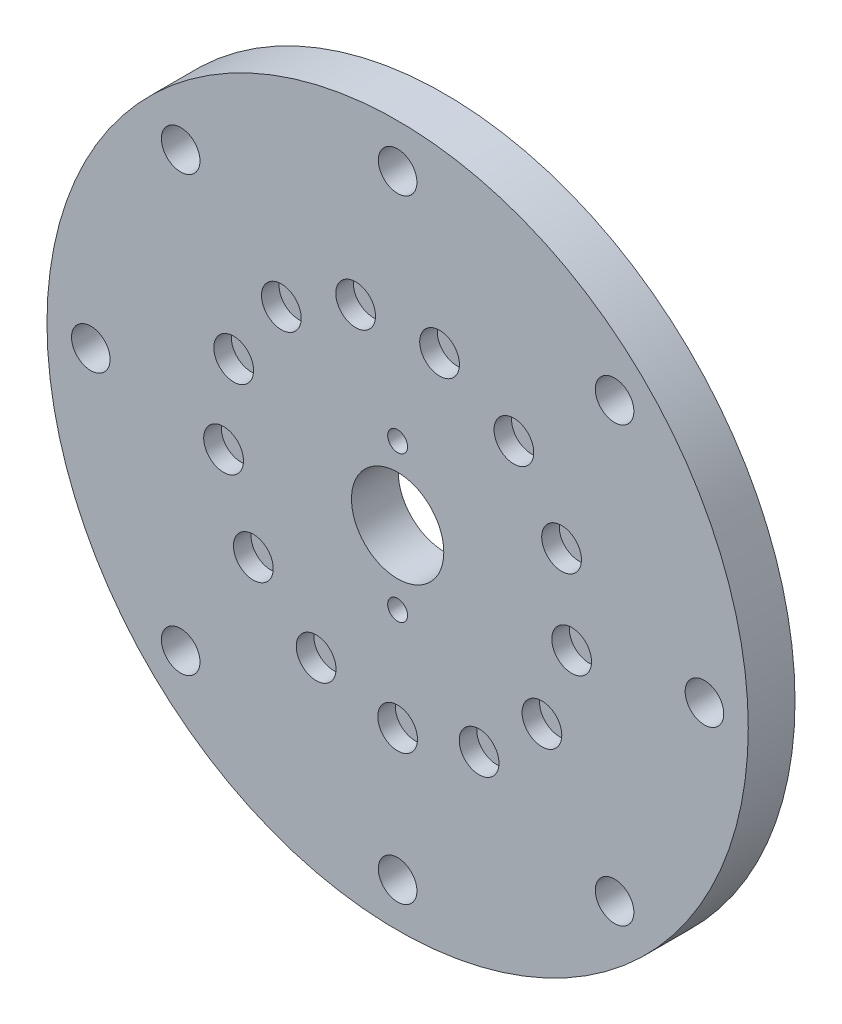
ISO-10303-21;
HEADER;
FILE_DESCRIPTION(('STEP AP214'),'2;1');
FILE_NAME('part.step','',(''),(''),'','','');
FILE_SCHEMA(('AUTOMOTIVE_DESIGN { 1 0 10303 214 1 1 1 1 }'));
ENDSEC;
DATA;
#1=APPLICATION_CONTEXT('core data for automotive mechanical design processes');
#2=APPLICATION_PROTOCOL_DEFINITION('international standard','automotive_design',2000,#1);
#3=PRODUCT_CONTEXT('',#1,'mechanical');
#4=PRODUCT('Part','Part','',(#3));
#5=PRODUCT_RELATED_PRODUCT_CATEGORY('part','',(#4));
#6=PRODUCT_DEFINITION_FORMATION('','',#4);
#7=PRODUCT_DEFINITION_CONTEXT('part definition',#1,'design');
#8=PRODUCT_DEFINITION('design','',#6,#7);
#9=PRODUCT_DEFINITION_SHAPE('','',#8);
#10=(LENGTH_UNIT() NAMED_UNIT(*) SI_UNIT(.MILLI.,.METRE.));
#11=(NAMED_UNIT(*) PLANE_ANGLE_UNIT() SI_UNIT($,.RADIAN.));
#12=(NAMED_UNIT(*) SI_UNIT($,.STERADIAN.) SOLID_ANGLE_UNIT());
#13=UNCERTAINTY_MEASURE_WITH_UNIT(LENGTH_MEASURE(1.E-05),#10,'distance_accuracy_value','');
#14=(GEOMETRIC_REPRESENTATION_CONTEXT(3) GLOBAL_UNCERTAINTY_ASSIGNED_CONTEXT((#13)) GLOBAL_UNIT_ASSIGNED_CONTEXT((#10,
#11,#12)) REPRESENTATION_CONTEXT('',''));
#15=CARTESIAN_POINT('',(0.,0.,0.));
#16=DIRECTION('',(0.,0.,1.));
#17=DIRECTION('',(1.,0.,0.));
#18=AXIS2_PLACEMENT_3D('',#15,#16,#17);
#19=CARTESIAN_POINT('',(0.,0.,8.));
#20=DIRECTION('',(0.,0.,1.));
#21=DIRECTION('',(1.,0.,0.));
#22=AXIS2_PLACEMENT_3D('',#19,#20,#21);
#23=PLANE('',#22);
#24=CARTESIAN_POINT('',(0.,52.5,8.));
#25=DIRECTION('',(0.,0.,1.));
#26=DIRECTION('',(1.,0.,0.));
#27=AXIS2_PLACEMENT_3D('',#24,#25,#26);
#28=CIRCLE('',#27,3.29999999999999);
#29=CARTESIAN_POINT('',(3.29999999999999,52.5,8.));
#30=VERTEX_POINT('',#29);
#31=EDGE_CURVE('E190',#30,#30,#28,.T.);
#32=ORIENTED_EDGE('',*,*,#31,.F.);
#33=EDGE_LOOP('',(#32));
#34=FACE_BOUND('',#33,.T.);
#35=CARTESIAN_POINT('',(37.1231060122937,37.1231060122937,8.));
#36=DIRECTION('',(0.,0.,1.));
#37=DIRECTION('',(1.,0.,0.));
#38=AXIS2_PLACEMENT_3D('',#35,#36,#37);
#39=CIRCLE('',#38,3.29999999999998);
#40=CARTESIAN_POINT('',(40.4231060122937,37.1231060122937,8.));
#41=VERTEX_POINT('',#40);
#42=EDGE_CURVE('E184',#41,#41,#39,.T.);
#43=ORIENTED_EDGE('',*,*,#42,.F.);
#44=EDGE_LOOP('',(#43));
#45=FACE_BOUND('',#44,.T.);
#46=CARTESIAN_POINT('',(52.5,0.,8.));
#47=DIRECTION('',(0.,0.,1.));
#48=DIRECTION('',(1.,0.,0.));
#49=AXIS2_PLACEMENT_3D('',#46,#47,#48);
#50=CIRCLE('',#49,3.29999999999998);
#51=CARTESIAN_POINT('',(55.8,0.,8.));
#52=VERTEX_POINT('',#51);
#53=EDGE_CURVE('E178',#52,#52,#50,.T.);
#54=ORIENTED_EDGE('',*,*,#53,.F.);
#55=EDGE_LOOP('',(#54));
#56=FACE_BOUND('',#55,.T.);
#57=CARTESIAN_POINT('',(37.1231060122937,-37.1231060122937,8.));
#58=DIRECTION('',(0.,0.,1.));
#59=DIRECTION('',(1.,0.,0.));
#60=AXIS2_PLACEMENT_3D('',#57,#58,#59);
#61=CIRCLE('',#60,3.29999999999998);
#62=CARTESIAN_POINT('',(40.4231060122937,-37.1231060122937,8.));
#63=VERTEX_POINT('',#62);
#64=EDGE_CURVE('E172',#63,#63,#61,.T.);
#65=ORIENTED_EDGE('',*,*,#64,.F.);
#66=EDGE_LOOP('',(#65));
#67=FACE_BOUND('',#66,.T.);
#68=CARTESIAN_POINT('',(0.,-52.5,8.));
#69=DIRECTION('',(0.,0.,1.));
#70=DIRECTION('',(1.,0.,0.));
#71=AXIS2_PLACEMENT_3D('',#68,#69,#70);
#72=CIRCLE('',#71,3.29999999999999);
#73=CARTESIAN_POINT('',(3.29999999999999,-52.5,8.));
#74=VERTEX_POINT('',#73);
#75=EDGE_CURVE('E166',#74,#74,#72,.T.);
#76=ORIENTED_EDGE('',*,*,#75,.F.);
#77=EDGE_LOOP('',(#76));
#78=FACE_BOUND('',#77,.T.);
#79=CARTESIAN_POINT('',(-37.1231060122937,-37.1231060122937,8.));
#80=DIRECTION('',(0.,0.,1.));
#81=DIRECTION('',(1.,0.,0.));
#82=AXIS2_PLACEMENT_3D('',#79,#80,#81);
#83=CIRCLE('',#82,3.29999999999998);
#84=CARTESIAN_POINT('',(-33.8231060122938,-37.1231060122937,8.));
#85=VERTEX_POINT('',#84);
#86=EDGE_CURVE('E160',#85,#85,#83,.T.);
#87=ORIENTED_EDGE('',*,*,#86,.F.);
#88=EDGE_LOOP('',(#87));
#89=FACE_BOUND('',#88,.T.);
#90=CARTESIAN_POINT('',(-52.5,0.,8.));
#91=DIRECTION('',(0.,0.,1.));
#92=DIRECTION('',(1.,0.,0.));
#93=AXIS2_PLACEMENT_3D('',#90,#91,#92);
#94=CIRCLE('',#93,3.29999999999998);
#95=CARTESIAN_POINT('',(-49.2,0.,8.));
#96=VERTEX_POINT('',#95);
#97=EDGE_CURVE('E154',#96,#96,#94,.T.);
#98=ORIENTED_EDGE('',*,*,#97,.F.);
#99=EDGE_LOOP('',(#98));
#100=FACE_BOUND('',#99,.T.);
#101=CARTESIAN_POINT('',(-37.1231060122937,37.1231060122937,8.));
#102=DIRECTION('',(0.,0.,1.));
#103=DIRECTION('',(1.,0.,0.));
#104=AXIS2_PLACEMENT_3D('',#101,#102,#103);
#105=CIRCLE('',#104,3.29999999999998);
#106=CARTESIAN_POINT('',(-33.8231060122938,37.1231060122937,8.));
#107=VERTEX_POINT('',#106);
#108=EDGE_CURVE('E148',#107,#107,#105,.T.);
#109=ORIENTED_EDGE('',*,*,#108,.F.);
#110=EDGE_LOOP('',(#109));
#111=FACE_BOUND('',#110,.T.);
#112=CARTESIAN_POINT('',(-19.893856446141,22.4551659023116,8.));
#113=DIRECTION('',(0.,0.,1.));
#114=DIRECTION('',(1.,0.,0.));
#115=AXIS2_PLACEMENT_3D('',#112,#113,#114);
#116=CIRCLE('',#115,3.4);
#117=CARTESIAN_POINT('',(-16.493856446141,22.4551659023116,8.));
#118=VERTEX_POINT('',#117);
#119=EDGE_CURVE('E101',#118,#118,#116,.T.);
#120=ORIENTED_EDGE('',*,*,#119,.F.);
#121=EDGE_LOOP('',(#120));
#122=FACE_BOUND('',#121,.T.);
#123=CARTESIAN_POINT('',(-28.0505709906068,10.6379258834103,8.));
#124=DIRECTION('',(0.,0.,1.));
#125=DIRECTION('',(1.,0.,0.));
#126=AXIS2_PLACEMENT_3D('',#123,#124,#125);
#127=CIRCLE('',#126,3.4);
#128=CARTESIAN_POINT('',(-24.6505709906068,10.6379258834103,8.));
#129=VERTEX_POINT('',#128);
#130=EDGE_CURVE('E108',#129,#129,#127,.T.);
#131=ORIENTED_EDGE('',*,*,#130,.F.);
#132=EDGE_LOOP('',(#131));
#133=FACE_BOUND('',#132,.T.);
#134=CARTESIAN_POINT('',(-29.7812377671508,-3.61633475447582,8.));
#135=DIRECTION('',(0.,0.,1.));
#136=DIRECTION('',(1.,0.,0.));
#137=AXIS2_PLACEMENT_3D('',#134,#135,#136);
#138=CIRCLE('',#137,3.4);
#139=CARTESIAN_POINT('',(-26.3812377671508,-3.61633475447582,8.));
#140=VERTEX_POINT('',#139);
#141=EDGE_CURVE('E114',#140,#140,#138,.T.);
#142=ORIENTED_EDGE('',*,*,#141,.F.);
#143=EDGE_LOOP('',(#142));
#144=FACE_BOUND('',#143,.T.);
#145=CARTESIAN_POINT('',(-24.6893818740625,-17.0421366816697,8.));
#146=DIRECTION('',(0.,0.,1.));
#147=DIRECTION('',(1.,0.,0.));
#148=AXIS2_PLACEMENT_3D('',#145,#146,#147);
#149=CIRCLE('',#148,3.4);
#150=CARTESIAN_POINT('',(-21.2893818740625,-17.0421366816697,8.));
#151=VERTEX_POINT('',#150);
#152=EDGE_CURVE('E78',#151,#151,#149,.T.);
#153=ORIENTED_EDGE('',*,*,#152,.F.);
#154=EDGE_LOOP('',(#153));
#155=FACE_BOUND('',#154,.T.);
#156=CARTESIAN_POINT('',(-13.9414861329328,-26.5637904751043,8.));
#157=DIRECTION('',(0.,0.,1.));
#158=DIRECTION('',(1.,0.,0.));
#159=AXIS2_PLACEMENT_3D('',#156,#157,#158);
#160=CIRCLE('',#159,3.4);
#161=CARTESIAN_POINT('',(-10.5414861329328,-26.5637904751043,8.));
#162=VERTEX_POINT('',#161);
#163=EDGE_CURVE('E77',#162,#162,#160,.T.);
#164=ORIENTED_EDGE('',*,*,#163,.F.);
#165=EDGE_LOOP('',(#164));
#166=FACE_BOUND('',#165,.T.);
#167=CARTESIAN_POINT('',(0.00023606813053362,-29.9999999990712,8.));
#168=DIRECTION('',(0.,0.,1.));
#169=DIRECTION('',(1.,0.,0.));
#170=AXIS2_PLACEMENT_3D('',#167,#168,#169);
#171=CIRCLE('',#170,3.4);
#172=CARTESIAN_POINT('',(3.40023606813053,-29.9999999990712,8.));
#173=VERTEX_POINT('',#172);
#174=EDGE_CURVE('E84',#173,#173,#171,.T.);
#175=ORIENTED_EDGE('',*,*,#174,.F.);
#176=EDGE_LOOP('',(#175));
#177=FACE_BOUND('',#176,.T.);
#178=CARTESIAN_POINT('',(13.9419041888301,-26.5635710624434,8.));
#179=DIRECTION('',(0.,0.,1.));
#180=DIRECTION('',(1.,0.,0.));
#181=AXIS2_PLACEMENT_3D('',#178,#179,#180);
#182=CIRCLE('',#181,3.4);
#183=CARTESIAN_POINT('',(17.3419041888301,-26.5635710624434,8.));
#184=VERTEX_POINT('',#183);
#185=EDGE_CURVE('E90',#184,#184,#182,.T.);
#186=ORIENTED_EDGE('',*,*,#185,.F.);
#187=EDGE_LOOP('',(#186));
#188=FACE_BOUND('',#187,.T.);
#189=CARTESIAN_POINT('',(24.6896500780281,-17.0417481211444,8.));
#190=DIRECTION('',(0.,0.,1.));
#191=DIRECTION('',(1.,0.,0.));
#192=AXIS2_PLACEMENT_3D('',#189,#190,#191);
#193=CIRCLE('',#192,3.4);
#194=CARTESIAN_POINT('',(28.0896500780281,-17.0417481211444,8.));
#195=VERTEX_POINT('',#194);
#196=EDGE_CURVE('E71',#195,#195,#193,.T.);
#197=ORIENTED_EDGE('',*,*,#196,.F.);
#198=EDGE_LOOP('',(#197));
#199=FACE_BOUND('',#198,.T.);
#200=CARTESIAN_POINT('',(-7.17969913682416,29.1281980270783,8.));
#201=DIRECTION('',(0.,0.,1.));
#202=DIRECTION('',(1.,0.,0.));
#203=AXIS2_PLACEMENT_3D('',#200,#201,#202);
#204=CIRCLE('',#203,3.4);
#205=CARTESIAN_POINT('',(-3.77969913682416,29.1281980270783,8.));
#206=VERTEX_POINT('',#205);
#207=EDGE_CURVE('E102',#206,#206,#204,.T.);
#208=ORIENTED_EDGE('',*,*,#207,.F.);
#209=EDGE_LOOP('',(#208));
#210=FACE_BOUND('',#209,.T.);
#211=CARTESIAN_POINT('',(7.17924071998474,29.1283110166812,8.));
#212=DIRECTION('',(0.,0.,1.));
#213=DIRECTION('',(1.,0.,0.));
#214=AXIS2_PLACEMENT_3D('',#211,#212,#213);
#215=CIRCLE('',#214,3.4);
#216=CARTESIAN_POINT('',(10.5792407199847,29.1283110166812,8.));
#217=VERTEX_POINT('',#216);
#218=EDGE_CURVE('E138',#217,#217,#215,.T.);
#219=ORIENTED_EDGE('',*,*,#218,.F.);
#220=EDGE_LOOP('',(#219));
#221=FACE_BOUND('',#220,.T.);
#222=CARTESIAN_POINT('',(19.8935030470749,22.4554789865641,8.));
#223=DIRECTION('',(0.,0.,1.));
#224=DIRECTION('',(1.,0.,0.));
#225=AXIS2_PLACEMENT_3D('',#222,#223,#224);
#226=CIRCLE('',#225,3.4);
#227=CARTESIAN_POINT('',(23.2935030470749,22.4554789865641,8.));
#228=VERTEX_POINT('',#227);
#229=EDGE_CURVE('E132',#228,#228,#226,.T.);
#230=ORIENTED_EDGE('',*,*,#229,.F.);
#231=EDGE_LOOP('',(#230));
#232=FACE_BOUND('',#231,.T.);
#233=CARTESIAN_POINT('',(28.0504035687812,10.6383673384831,8.));
#234=DIRECTION('',(0.,0.,1.));
#235=DIRECTION('',(1.,0.,0.));
#236=AXIS2_PLACEMENT_3D('',#233,#234,#235);
#237=CIRCLE('',#236,3.4);
#238=CARTESIAN_POINT('',(31.4504035687812,10.6383673384831,8.));
#239=VERTEX_POINT('',#238);
#240=EDGE_CURVE('E125',#239,#239,#237,.T.);
#241=ORIENTED_EDGE('',*,*,#240,.F.);
#242=EDGE_LOOP('',(#241));
#243=FACE_BOUND('',#242,.T.);
#244=CARTESIAN_POINT('',(29.7812946768884,-3.61586606061967,8.));
#245=DIRECTION('',(0.,0.,1.));
#246=DIRECTION('',(1.,0.,0.));
#247=AXIS2_PLACEMENT_3D('',#244,#245,#246);
#248=CIRCLE('',#247,3.4);
#249=CARTESIAN_POINT('',(33.1812946768884,-3.61586606061967,8.));
#250=VERTEX_POINT('',#249);
#251=EDGE_CURVE('E68',#250,#250,#248,.T.);
#252=ORIENTED_EDGE('',*,*,#251,.F.);
#253=EDGE_LOOP('',(#252));
#254=FACE_BOUND('',#253,.T.);
#255=CARTESIAN_POINT('',(0.,12.5,8.));
#256=DIRECTION('',(0.,0.,1.));
#257=DIRECTION('',(1.,0.,0.));
#258=AXIS2_PLACEMENT_3D('',#255,#256,#257);
#259=CIRCLE('',#258,1.7);
#260=CARTESIAN_POINT('',(1.7,12.5,8.));
#261=VERTEX_POINT('',#260);
#262=EDGE_CURVE('E63',#261,#261,#259,.T.);
#263=ORIENTED_EDGE('',*,*,#262,.F.);
#264=EDGE_LOOP('',(#263));
#265=FACE_BOUND('',#264,.T.);
#266=CARTESIAN_POINT('',(0.,-12.5,8.));
#267=DIRECTION('',(0.,0.,1.));
#268=DIRECTION('',(1.,0.,0.));
#269=AXIS2_PLACEMENT_3D('',#266,#267,#268);
#270=CIRCLE('',#269,1.7);
#271=CARTESIAN_POINT('',(1.7,-12.5,8.));
#272=VERTEX_POINT('',#271);
#273=EDGE_CURVE('E59',#272,#272,#270,.T.);
#274=ORIENTED_EDGE('',*,*,#273,.F.);
#275=EDGE_LOOP('',(#274));
#276=FACE_BOUND('',#275,.T.);
#277=CARTESIAN_POINT('',(0.,0.,8.));
#278=DIRECTION('',(0.,0.,1.));
#279=DIRECTION('',(1.,0.,0.));
#280=AXIS2_PLACEMENT_3D('',#277,#278,#279);
#281=CIRCLE('',#280,60.);
#282=CARTESIAN_POINT('',(60.,0.,8.));
#283=VERTEX_POINT('',#282);
#284=EDGE_CURVE('E10',#283,#283,#281,.T.);
#285=ORIENTED_EDGE('',*,*,#284,.T.);
#286=EDGE_LOOP('',(#285));
#287=FACE_BOUND('',#286,.T.);
#288=CARTESIAN_POINT('',(0.,0.,8.));
#289=DIRECTION('',(0.,0.,1.));
#290=DIRECTION('',(1.,0.,0.));
#291=AXIS2_PLACEMENT_3D('',#288,#289,#290);
#292=CIRCLE('',#291,7.9);
#293=CARTESIAN_POINT('',(7.9,0.,8.));
#294=VERTEX_POINT('',#293);
#295=EDGE_CURVE('E48',#294,#294,#292,.T.);
#296=ORIENTED_EDGE('',*,*,#295,.F.);
#297=EDGE_LOOP('',(#296));
#298=FACE_BOUND('',#297,.T.);
#299=ADVANCED_FACE('F37',(#34,#45,#56,#67,#78,#89,#100,#111,#122,#133,#144,#155,#166,#177,#188,
#199,#210,#221,#232,#243,#254,#265,#276,#287,#298),#23,.T.);
#300=CARTESIAN_POINT('',(0.,0.,0.));
#301=DIRECTION('',(0.,0.,1.));
#302=DIRECTION('',(1.,0.,0.));
#303=AXIS2_PLACEMENT_3D('',#300,#301,#302);
#304=PLANE('',#303);
#305=CARTESIAN_POINT('',(0.,52.5,0.));
#306=DIRECTION('',(0.,0.,1.));
#307=DIRECTION('',(1.,0.,0.));
#308=AXIS2_PLACEMENT_3D('',#305,#306,#307);
#309=CIRCLE('',#308,3.3);
#310=CARTESIAN_POINT('',(3.3,52.5,0.));
#311=VERTEX_POINT('',#310);
#312=EDGE_CURVE('E187',#311,#311,#309,.T.);
#313=ORIENTED_EDGE('',*,*,#312,.T.);
#314=EDGE_LOOP('',(#313));
#315=FACE_BOUND('',#314,.T.);
#316=CARTESIAN_POINT('',(37.1231060122937,37.1231060122937,0.));
#317=DIRECTION('',(0.,0.,1.));
#318=DIRECTION('',(1.,0.,0.));
#319=AXIS2_PLACEMENT_3D('',#316,#317,#318);
#320=CIRCLE('',#319,3.3);
#321=CARTESIAN_POINT('',(40.4231060122937,37.1231060122937,0.));
#322=VERTEX_POINT('',#321);
#323=EDGE_CURVE('E181',#322,#322,#320,.T.);
#324=ORIENTED_EDGE('',*,*,#323,.T.);
#325=EDGE_LOOP('',(#324));
#326=FACE_BOUND('',#325,.T.);
#327=CARTESIAN_POINT('',(52.5,0.,0.));
#328=DIRECTION('',(0.,0.,1.));
#329=DIRECTION('',(1.,0.,0.));
#330=AXIS2_PLACEMENT_3D('',#327,#328,#329);
#331=CIRCLE('',#330,3.3);
#332=CARTESIAN_POINT('',(55.8,0.,0.));
#333=VERTEX_POINT('',#332);
#334=EDGE_CURVE('E175',#333,#333,#331,.T.);
#335=ORIENTED_EDGE('',*,*,#334,.T.);
#336=EDGE_LOOP('',(#335));
#337=FACE_BOUND('',#336,.T.);
#338=CARTESIAN_POINT('',(37.1231060122937,-37.1231060122937,0.));
#339=DIRECTION('',(0.,0.,1.));
#340=DIRECTION('',(1.,0.,0.));
#341=AXIS2_PLACEMENT_3D('',#338,#339,#340);
#342=CIRCLE('',#341,3.3);
#343=CARTESIAN_POINT('',(40.4231060122937,-37.1231060122937,0.));
#344=VERTEX_POINT('',#343);
#345=EDGE_CURVE('E169',#344,#344,#342,.T.);
#346=ORIENTED_EDGE('',*,*,#345,.T.);
#347=EDGE_LOOP('',(#346));
#348=FACE_BOUND('',#347,.T.);
#349=CARTESIAN_POINT('',(0.,-52.5,0.));
#350=DIRECTION('',(0.,0.,1.));
#351=DIRECTION('',(1.,0.,0.));
#352=AXIS2_PLACEMENT_3D('',#349,#350,#351);
#353=CIRCLE('',#352,3.3);
#354=CARTESIAN_POINT('',(3.30000000000001,-52.5,0.));
#355=VERTEX_POINT('',#354);
#356=EDGE_CURVE('E163',#355,#355,#353,.T.);
#357=ORIENTED_EDGE('',*,*,#356,.T.);
#358=EDGE_LOOP('',(#357));
#359=FACE_BOUND('',#358,.T.);
#360=CARTESIAN_POINT('',(-37.1231060122937,-37.1231060122937,0.));
#361=DIRECTION('',(0.,0.,1.));
#362=DIRECTION('',(1.,0.,0.));
#363=AXIS2_PLACEMENT_3D('',#360,#361,#362);
#364=CIRCLE('',#363,3.3);
#365=CARTESIAN_POINT('',(-33.8231060122937,-37.1231060122937,0.));
#366=VERTEX_POINT('',#365);
#367=EDGE_CURVE('E157',#366,#366,#364,.T.);
#368=ORIENTED_EDGE('',*,*,#367,.T.);
#369=EDGE_LOOP('',(#368));
#370=FACE_BOUND('',#369,.T.);
#371=CARTESIAN_POINT('',(-52.5,0.,0.));
#372=DIRECTION('',(0.,0.,1.));
#373=DIRECTION('',(1.,0.,0.));
#374=AXIS2_PLACEMENT_3D('',#371,#372,#373);
#375=CIRCLE('',#374,3.3);
#376=CARTESIAN_POINT('',(-49.2,0.,0.));
#377=VERTEX_POINT('',#376);
#378=EDGE_CURVE('E151',#377,#377,#375,.T.);
#379=ORIENTED_EDGE('',*,*,#378,.T.);
#380=EDGE_LOOP('',(#379));
#381=FACE_BOUND('',#380,.T.);
#382=CARTESIAN_POINT('',(-37.1231060122937,37.1231060122937,0.));
#383=DIRECTION('',(0.,0.,1.));
#384=DIRECTION('',(1.,0.,0.));
#385=AXIS2_PLACEMENT_3D('',#382,#383,#384);
#386=CIRCLE('',#385,3.3);
#387=CARTESIAN_POINT('',(-33.8231060122937,37.1231060122937,0.));
#388=VERTEX_POINT('',#387);
#389=EDGE_CURVE('E126',#388,#388,#386,.T.);
#390=ORIENTED_EDGE('',*,*,#389,.T.);
#391=EDGE_LOOP('',(#390));
#392=FACE_BOUND('',#391,.T.);
#393=CARTESIAN_POINT('',(0.,12.5,0.));
#394=DIRECTION('',(0.,0.,1.));
#395=DIRECTION('',(1.,0.,0.));
#396=AXIS2_PLACEMENT_3D('',#393,#394,#395);
#397=CIRCLE('',#396,1.7);
#398=CARTESIAN_POINT('',(1.7,12.5,0.));
#399=VERTEX_POINT('',#398);
#400=EDGE_CURVE('E53',#399,#399,#397,.T.);
#401=ORIENTED_EDGE('',*,*,#400,.T.);
#402=EDGE_LOOP('',(#401));
#403=FACE_BOUND('',#402,.T.);
#404=CARTESIAN_POINT('',(0.,-12.5,0.));
#405=DIRECTION('',(0.,0.,1.));
#406=DIRECTION('',(1.,0.,0.));
#407=AXIS2_PLACEMENT_3D('',#404,#405,#406);
#408=CIRCLE('',#407,1.7);
#409=CARTESIAN_POINT('',(1.7,-12.5,0.));
#410=VERTEX_POINT('',#409);
#411=EDGE_CURVE('E56',#410,#410,#408,.T.);
#412=ORIENTED_EDGE('',*,*,#411,.T.);
#413=EDGE_LOOP('',(#412));
#414=FACE_BOUND('',#413,.T.);
#415=CARTESIAN_POINT('',(0.,0.,0.));
#416=DIRECTION('',(0.,0.,1.));
#417=DIRECTION('',(1.,0.,0.));
#418=AXIS2_PLACEMENT_3D('',#415,#416,#417);
#419=CIRCLE('',#418,60.);
#420=CARTESIAN_POINT('',(60.,0.,0.));
#421=VERTEX_POINT('',#420);
#422=EDGE_CURVE('E41',#421,#421,#419,.T.);
#423=ORIENTED_EDGE('',*,*,#422,.F.);
#424=EDGE_LOOP('',(#423));
#425=FACE_BOUND('',#424,.T.);
#426=CARTESIAN_POINT('',(0.,0.,0.));
#427=DIRECTION('',(0.,0.,1.));
#428=DIRECTION('',(1.,0.,0.));
#429=AXIS2_PLACEMENT_3D('',#426,#427,#428);
#430=CIRCLE('',#429,7.9);
#431=CARTESIAN_POINT('',(7.9,0.,0.));
#432=VERTEX_POINT('',#431);
#433=EDGE_CURVE('E50',#432,#432,#430,.T.);
#434=ORIENTED_EDGE('',*,*,#433,.T.);
#435=EDGE_LOOP('',(#434));
#436=FACE_BOUND('',#435,.T.);
#437=ADVANCED_FACE('F198',(#315,#326,#337,#348,#359,#370,#381,#392,#403,#414,#425,#436),#304,.F.);
#438=CARTESIAN_POINT('',(0.,0.,8.));
#439=DIRECTION('',(0.,0.,-1.));
#440=DIRECTION('',(-1.,0.,0.));
#441=AXIS2_PLACEMENT_3D('',#438,#439,#440);
#442=CYLINDRICAL_SURFACE('',#441,60.);
#443=ORIENTED_EDGE('',*,*,#284,.F.);
#444=EDGE_LOOP('',(#443));
#445=FACE_BOUND('',#444,.T.);
#446=ORIENTED_EDGE('',*,*,#422,.T.);
#447=EDGE_LOOP('',(#446));
#448=FACE_BOUND('',#447,.T.);
#449=ADVANCED_FACE('F39',(#445,#448),#442,.T.);
#450=CARTESIAN_POINT('',(0.,0.,8.));
#451=DIRECTION('',(0.,0.,-1.));
#452=DIRECTION('',(-1.,0.,0.));
#453=AXIS2_PLACEMENT_3D('',#450,#451,#452);
#454=CYLINDRICAL_SURFACE('',#453,7.9);
#455=ORIENTED_EDGE('',*,*,#295,.T.);
#456=EDGE_LOOP('',(#455));
#457=FACE_BOUND('',#456,.T.);
#458=ORIENTED_EDGE('',*,*,#433,.F.);
#459=EDGE_LOOP('',(#458));
#460=FACE_BOUND('',#459,.T.);
#461=ADVANCED_FACE('F246',(#457,#460),#454,.F.);
#462=CARTESIAN_POINT('',(0.,-12.5,0.));
#463=DIRECTION('',(0.,0.,1.));
#464=DIRECTION('',(1.,0.,0.));
#465=AXIS2_PLACEMENT_3D('',#462,#463,#464);
#466=CYLINDRICAL_SURFACE('',#465,1.7);
#467=ORIENTED_EDGE('',*,*,#411,.F.);
#468=EDGE_LOOP('',(#467));
#469=FACE_BOUND('',#468,.T.);
#470=ORIENTED_EDGE('',*,*,#273,.T.);
#471=EDGE_LOOP('',(#470));
#472=FACE_BOUND('',#471,.T.);
#473=ADVANCED_FACE('F249',(#469,#472),#466,.F.);
#474=CARTESIAN_POINT('',(0.,12.5,0.));
#475=DIRECTION('',(0.,0.,1.));
#476=DIRECTION('',(1.,0.,0.));
#477=AXIS2_PLACEMENT_3D('',#474,#475,#476);
#478=CYLINDRICAL_SURFACE('',#477,1.7);
#479=ORIENTED_EDGE('',*,*,#400,.F.);
#480=EDGE_LOOP('',(#479));
#481=FACE_BOUND('',#480,.T.);
#482=ORIENTED_EDGE('',*,*,#262,.T.);
#483=EDGE_LOOP('',(#482));
#484=FACE_BOUND('',#483,.T.);
#485=ADVANCED_FACE('F264',(#481,#484),#478,.F.);
#486=CARTESIAN_POINT('',(29.7812946768884,-3.61586606061967,5.));
#487=DIRECTION('',(0.,0.,1.));
#488=DIRECTION('',(1.,0.,0.));
#489=AXIS2_PLACEMENT_3D('',#486,#487,#488);
#490=CYLINDRICAL_SURFACE('',#489,3.4);
#491=CARTESIAN_POINT('',(29.7812946768884,-3.61586606061967,5.));
#492=DIRECTION('',(0.,0.,1.));
#493=DIRECTION('',(1.,0.,0.));
#494=AXIS2_PLACEMENT_3D('',#491,#492,#493);
#495=CIRCLE('',#494,3.4);
#496=CARTESIAN_POINT('',(33.1812946768884,-3.61586606061967,5.));
#497=VERTEX_POINT('',#496);
#498=EDGE_CURVE('E60',#497,#497,#495,.T.);
#499=ORIENTED_EDGE('',*,*,#498,.F.);
#500=EDGE_LOOP('',(#499));
#501=FACE_BOUND('',#500,.T.);
#502=ORIENTED_EDGE('',*,*,#251,.T.);
#503=EDGE_LOOP('',(#502));
#504=FACE_BOUND('',#503,.T.);
#505=ADVANCED_FACE('F268',(#501,#504),#490,.F.);
#506=CARTESIAN_POINT('',(29.7812946768884,-3.61586606061967,5.));
#507=DIRECTION('',(0.,0.,1.));
#508=DIRECTION('',(1.,0.,0.));
#509=AXIS2_PLACEMENT_3D('',#506,#507,#508);
#510=PLANE('',#509);
#511=ORIENTED_EDGE('',*,*,#498,.T.);
#512=EDGE_LOOP('',(#511));
#513=FACE_BOUND('',#512,.T.);
#514=ADVANCED_FACE('F272',(#513),#510,.T.);
#515=CARTESIAN_POINT('',(28.0504035687812,10.6383673384831,5.));
#516=DIRECTION('',(0.,0.,1.));
#517=DIRECTION('',(1.,0.,0.));
#518=AXIS2_PLACEMENT_3D('',#515,#516,#517);
#519=CYLINDRICAL_SURFACE('',#518,3.4);
#520=CARTESIAN_POINT('',(28.0504035687812,10.6383673384831,5.));
#521=DIRECTION('',(0.,0.,1.));
#522=DIRECTION('',(1.,0.,0.));
#523=AXIS2_PLACEMENT_3D('',#520,#521,#522);
#524=CIRCLE('',#523,3.4);
#525=CARTESIAN_POINT('',(31.4504035687812,10.6383673384831,5.));
#526=VERTEX_POINT('',#525);
#527=EDGE_CURVE('E122',#526,#526,#524,.T.);
#528=ORIENTED_EDGE('',*,*,#527,.F.);
#529=EDGE_LOOP('',(#528));
#530=FACE_BOUND('',#529,.T.);
#531=ORIENTED_EDGE('',*,*,#240,.T.);
#532=EDGE_LOOP('',(#531));
#533=FACE_BOUND('',#532,.T.);
#534=ADVANCED_FACE('F276',(#530,#533),#519,.F.);
#535=CARTESIAN_POINT('',(28.0504035687812,10.6383673384831,5.));
#536=DIRECTION('',(0.,0.,1.));
#537=DIRECTION('',(1.,0.,0.));
#538=AXIS2_PLACEMENT_3D('',#535,#536,#537);
#539=PLANE('',#538);
#540=ORIENTED_EDGE('',*,*,#527,.T.);
#541=EDGE_LOOP('',(#540));
#542=FACE_BOUND('',#541,.T.);
#543=ADVANCED_FACE('F344',(#542),#539,.T.);
#544=CARTESIAN_POINT('',(19.8935030470749,22.4554789865641,5.));
#545=DIRECTION('',(0.,0.,1.));
#546=DIRECTION('',(1.,0.,0.));
#547=AXIS2_PLACEMENT_3D('',#544,#545,#546);
#548=CYLINDRICAL_SURFACE('',#547,3.4);
#549=CARTESIAN_POINT('',(19.8935030470749,22.4554789865641,5.));
#550=DIRECTION('',(0.,0.,1.));
#551=DIRECTION('',(1.,0.,0.));
#552=AXIS2_PLACEMENT_3D('',#549,#550,#551);
#553=CIRCLE('',#552,3.4);
#554=CARTESIAN_POINT('',(23.2935030470749,22.4554789865641,5.));
#555=VERTEX_POINT('',#554);
#556=EDGE_CURVE('E129',#555,#555,#553,.T.);
#557=ORIENTED_EDGE('',*,*,#556,.F.);
#558=EDGE_LOOP('',(#557));
#559=FACE_BOUND('',#558,.T.);
#560=ORIENTED_EDGE('',*,*,#229,.T.);
#561=EDGE_LOOP('',(#560));
#562=FACE_BOUND('',#561,.T.);
#563=ADVANCED_FACE('F347',(#559,#562),#548,.F.);
#564=CARTESIAN_POINT('',(19.8935030470749,22.4554789865641,5.));
#565=DIRECTION('',(0.,0.,1.));
#566=DIRECTION('',(1.,0.,0.));
#567=AXIS2_PLACEMENT_3D('',#564,#565,#566);
#568=PLANE('',#567);
#569=ORIENTED_EDGE('',*,*,#556,.T.);
#570=EDGE_LOOP('',(#569));
#571=FACE_BOUND('',#570,.T.);
#572=ADVANCED_FACE('F352',(#571),#568,.T.);
#573=CARTESIAN_POINT('',(7.17924071998474,29.1283110166812,5.));
#574=DIRECTION('',(0.,0.,1.));
#575=DIRECTION('',(1.,0.,0.));
#576=AXIS2_PLACEMENT_3D('',#573,#574,#575);
#577=CYLINDRICAL_SURFACE('',#576,3.4);
#578=CARTESIAN_POINT('',(7.17924071998474,29.1283110166812,5.));
#579=DIRECTION('',(0.,0.,1.));
#580=DIRECTION('',(1.,0.,0.));
#581=AXIS2_PLACEMENT_3D('',#578,#579,#580);
#582=CIRCLE('',#581,3.4);
#583=CARTESIAN_POINT('',(10.5792407199847,29.1283110166812,5.));
#584=VERTEX_POINT('',#583);
#585=EDGE_CURVE('E135',#584,#584,#582,.T.);
#586=ORIENTED_EDGE('',*,*,#585,.F.);
#587=EDGE_LOOP('',(#586));
#588=FACE_BOUND('',#587,.T.);
#589=ORIENTED_EDGE('',*,*,#218,.T.);
#590=EDGE_LOOP('',(#589));
#591=FACE_BOUND('',#590,.T.);
#592=ADVANCED_FACE('F355',(#588,#591),#577,.F.);
#593=CARTESIAN_POINT('',(7.17924071998474,29.1283110166812,5.));
#594=DIRECTION('',(0.,0.,1.));
#595=DIRECTION('',(1.,0.,0.));
#596=AXIS2_PLACEMENT_3D('',#593,#594,#595);
#597=PLANE('',#596);
#598=ORIENTED_EDGE('',*,*,#585,.T.);
#599=EDGE_LOOP('',(#598));
#600=FACE_BOUND('',#599,.T.);
#601=ADVANCED_FACE('F360',(#600),#597,.T.);
#602=CARTESIAN_POINT('',(-7.17969913682416,29.1281980270783,5.));
#603=DIRECTION('',(0.,0.,1.));
#604=DIRECTION('',(1.,0.,0.));
#605=AXIS2_PLACEMENT_3D('',#602,#603,#604);
#606=CYLINDRICAL_SURFACE('',#605,3.4);
#607=CARTESIAN_POINT('',(-7.17969913682416,29.1281980270783,5.));
#608=DIRECTION('',(0.,0.,1.));
#609=DIRECTION('',(1.,0.,0.));
#610=AXIS2_PLACEMENT_3D('',#607,#608,#609);
#611=CIRCLE('',#610,3.4);
#612=CARTESIAN_POINT('',(-3.77969913682416,29.1281980270783,5.));
#613=VERTEX_POINT('',#612);
#614=EDGE_CURVE('E141',#613,#613,#611,.T.);
#615=ORIENTED_EDGE('',*,*,#614,.F.);
#616=EDGE_LOOP('',(#615));
#617=FACE_BOUND('',#616,.T.);
#618=ORIENTED_EDGE('',*,*,#207,.T.);
#619=EDGE_LOOP('',(#618));
#620=FACE_BOUND('',#619,.T.);
#621=ADVANCED_FACE('F363',(#617,#620),#606,.F.);
#622=CARTESIAN_POINT('',(-7.17969913682416,29.1281980270783,5.));
#623=DIRECTION('',(0.,0.,1.));
#624=DIRECTION('',(1.,0.,0.));
#625=AXIS2_PLACEMENT_3D('',#622,#623,#624);
#626=PLANE('',#625);
#627=ORIENTED_EDGE('',*,*,#614,.T.);
#628=EDGE_LOOP('',(#627));
#629=FACE_BOUND('',#628,.T.);
#630=ADVANCED_FACE('F310',(#629),#626,.T.);
#631=CARTESIAN_POINT('',(24.6896500780281,-17.0417481211444,5.));
#632=DIRECTION('',(0.,0.,1.));
#633=DIRECTION('',(1.,0.,0.));
#634=AXIS2_PLACEMENT_3D('',#631,#632,#633);
#635=CYLINDRICAL_SURFACE('',#634,3.4);
#636=CARTESIAN_POINT('',(24.6896500780281,-17.0417481211444,5.));
#637=DIRECTION('',(0.,0.,1.));
#638=DIRECTION('',(1.,0.,0.));
#639=AXIS2_PLACEMENT_3D('',#636,#637,#638);
#640=CIRCLE('',#639,3.4);
#641=CARTESIAN_POINT('',(28.0896500780281,-17.0417481211444,5.));
#642=VERTEX_POINT('',#641);
#643=EDGE_CURVE('E93',#642,#642,#640,.T.);
#644=ORIENTED_EDGE('',*,*,#643,.F.);
#645=EDGE_LOOP('',(#644));
#646=FACE_BOUND('',#645,.T.);
#647=ORIENTED_EDGE('',*,*,#196,.T.);
#648=EDGE_LOOP('',(#647));
#649=FACE_BOUND('',#648,.T.);
#650=ADVANCED_FACE('F306',(#646,#649),#635,.F.);
#651=CARTESIAN_POINT('',(24.6896500780281,-17.0417481211444,5.));
#652=DIRECTION('',(0.,0.,1.));
#653=DIRECTION('',(1.,0.,0.));
#654=AXIS2_PLACEMENT_3D('',#651,#652,#653);
#655=PLANE('',#654);
#656=ORIENTED_EDGE('',*,*,#643,.T.);
#657=EDGE_LOOP('',(#656));
#658=FACE_BOUND('',#657,.T.);
#659=ADVANCED_FACE('F302',(#658),#655,.T.);
#660=CARTESIAN_POINT('',(13.9419041888301,-26.5635710624434,5.));
#661=DIRECTION('',(0.,0.,1.));
#662=DIRECTION('',(1.,0.,0.));
#663=AXIS2_PLACEMENT_3D('',#660,#661,#662);
#664=CYLINDRICAL_SURFACE('',#663,3.4);
#665=CARTESIAN_POINT('',(13.9419041888301,-26.5635710624434,5.));
#666=DIRECTION('',(0.,0.,1.));
#667=DIRECTION('',(1.,0.,0.));
#668=AXIS2_PLACEMENT_3D('',#665,#666,#667);
#669=CIRCLE('',#668,3.4);
#670=CARTESIAN_POINT('',(17.3419041888301,-26.5635710624434,5.));
#671=VERTEX_POINT('',#670);
#672=EDGE_CURVE('E87',#671,#671,#669,.T.);
#673=ORIENTED_EDGE('',*,*,#672,.F.);
#674=EDGE_LOOP('',(#673));
#675=FACE_BOUND('',#674,.T.);
#676=ORIENTED_EDGE('',*,*,#185,.T.);
#677=EDGE_LOOP('',(#676));
#678=FACE_BOUND('',#677,.T.);
#679=ADVANCED_FACE('F298',(#675,#678),#664,.F.);
#680=CARTESIAN_POINT('',(13.9419041888301,-26.5635710624434,5.));
#681=DIRECTION('',(0.,0.,1.));
#682=DIRECTION('',(1.,0.,0.));
#683=AXIS2_PLACEMENT_3D('',#680,#681,#682);
#684=PLANE('',#683);
#685=ORIENTED_EDGE('',*,*,#672,.T.);
#686=EDGE_LOOP('',(#685));
#687=FACE_BOUND('',#686,.T.);
#688=ADVANCED_FACE('F294',(#687),#684,.T.);
#689=CARTESIAN_POINT('',(0.00023606813053362,-29.9999999990712,5.));
#690=DIRECTION('',(0.,0.,1.));
#691=DIRECTION('',(1.,0.,0.));
#692=AXIS2_PLACEMENT_3D('',#689,#690,#691);
#693=CYLINDRICAL_SURFACE('',#692,3.4);
#694=CARTESIAN_POINT('',(0.00023606813053362,-29.9999999990712,5.));
#695=DIRECTION('',(0.,0.,1.));
#696=DIRECTION('',(1.,0.,0.));
#697=AXIS2_PLACEMENT_3D('',#694,#695,#696);
#698=CIRCLE('',#697,3.4);
#699=CARTESIAN_POINT('',(3.40023606813053,-29.9999999990712,5.));
#700=VERTEX_POINT('',#699);
#701=EDGE_CURVE('E81',#700,#700,#698,.T.);
#702=ORIENTED_EDGE('',*,*,#701,.F.);
#703=EDGE_LOOP('',(#702));
#704=FACE_BOUND('',#703,.T.);
#705=ORIENTED_EDGE('',*,*,#174,.T.);
#706=EDGE_LOOP('',(#705));
#707=FACE_BOUND('',#706,.T.);
#708=ADVANCED_FACE('F290',(#704,#707),#693,.F.);
#709=CARTESIAN_POINT('',(0.00023606813053362,-29.9999999990712,5.));
#710=DIRECTION('',(0.,0.,1.));
#711=DIRECTION('',(1.,0.,0.));
#712=AXIS2_PLACEMENT_3D('',#709,#710,#711);
#713=PLANE('',#712);
#714=ORIENTED_EDGE('',*,*,#701,.T.);
#715=EDGE_LOOP('',(#714));
#716=FACE_BOUND('',#715,.T.);
#717=ADVANCED_FACE('F286',(#716),#713,.T.);
#718=CARTESIAN_POINT('',(-13.9414861329328,-26.5637904751043,5.));
#719=DIRECTION('',(0.,0.,1.));
#720=DIRECTION('',(1.,0.,0.));
#721=AXIS2_PLACEMENT_3D('',#718,#719,#720);
#722=CYLINDRICAL_SURFACE('',#721,3.4);
#723=CARTESIAN_POINT('',(-13.9414861329328,-26.5637904751043,5.));
#724=DIRECTION('',(0.,0.,1.));
#725=DIRECTION('',(1.,0.,0.));
#726=AXIS2_PLACEMENT_3D('',#723,#724,#725);
#727=CIRCLE('',#726,3.4);
#728=CARTESIAN_POINT('',(-10.5414861329328,-26.5637904751043,5.));
#729=VERTEX_POINT('',#728);
#730=EDGE_CURVE('E74',#729,#729,#727,.T.);
#731=ORIENTED_EDGE('',*,*,#730,.F.);
#732=EDGE_LOOP('',(#731));
#733=FACE_BOUND('',#732,.T.);
#734=ORIENTED_EDGE('',*,*,#163,.T.);
#735=EDGE_LOOP('',(#734));
#736=FACE_BOUND('',#735,.T.);
#737=ADVANCED_FACE('F282',(#733,#736),#722,.F.);
#738=CARTESIAN_POINT('',(-13.9414861329328,-26.5637904751043,5.));
#739=DIRECTION('',(0.,0.,1.));
#740=DIRECTION('',(1.,0.,0.));
#741=AXIS2_PLACEMENT_3D('',#738,#739,#740);
#742=PLANE('',#741);
#743=ORIENTED_EDGE('',*,*,#730,.T.);
#744=EDGE_LOOP('',(#743));
#745=FACE_BOUND('',#744,.T.);
#746=ADVANCED_FACE('F278',(#745),#742,.T.);
#747=CARTESIAN_POINT('',(-24.6893818740625,-17.0421366816697,5.));
#748=DIRECTION('',(0.,0.,1.));
#749=DIRECTION('',(1.,0.,0.));
#750=AXIS2_PLACEMENT_3D('',#747,#748,#749);
#751=CYLINDRICAL_SURFACE('',#750,3.4);
#752=CARTESIAN_POINT('',(-24.6893818740625,-17.0421366816697,5.));
#753=DIRECTION('',(0.,0.,1.));
#754=DIRECTION('',(1.,0.,0.));
#755=AXIS2_PLACEMENT_3D('',#752,#753,#754);
#756=CIRCLE('',#755,3.4);
#757=CARTESIAN_POINT('',(-21.2893818740625,-17.0421366816697,5.));
#758=VERTEX_POINT('',#757);
#759=EDGE_CURVE('E117',#758,#758,#756,.T.);
#760=ORIENTED_EDGE('',*,*,#759,.F.);
#761=EDGE_LOOP('',(#760));
#762=FACE_BOUND('',#761,.T.);
#763=ORIENTED_EDGE('',*,*,#152,.T.);
#764=EDGE_LOOP('',(#763));
#765=FACE_BOUND('',#764,.T.);
#766=ADVANCED_FACE('F281',(#762,#765),#751,.F.);
#767=CARTESIAN_POINT('',(-24.6893818740625,-17.0421366816697,5.));
#768=DIRECTION('',(0.,0.,1.));
#769=DIRECTION('',(1.,0.,0.));
#770=AXIS2_PLACEMENT_3D('',#767,#768,#769);
#771=PLANE('',#770);
#772=ORIENTED_EDGE('',*,*,#759,.T.);
#773=EDGE_LOOP('',(#772));
#774=FACE_BOUND('',#773,.T.);
#775=ADVANCED_FACE('F336',(#774),#771,.T.);
#776=CARTESIAN_POINT('',(-29.7812377671508,-3.61633475447582,5.));
#777=DIRECTION('',(0.,0.,1.));
#778=DIRECTION('',(1.,0.,0.));
#779=AXIS2_PLACEMENT_3D('',#776,#777,#778);
#780=CYLINDRICAL_SURFACE('',#779,3.4);
#781=CARTESIAN_POINT('',(-29.7812377671508,-3.61633475447582,5.));
#782=DIRECTION('',(0.,0.,1.));
#783=DIRECTION('',(1.,0.,0.));
#784=AXIS2_PLACEMENT_3D('',#781,#782,#783);
#785=CIRCLE('',#784,3.4);
#786=CARTESIAN_POINT('',(-26.3812377671508,-3.61633475447582,5.));
#787=VERTEX_POINT('',#786);
#788=EDGE_CURVE('E111',#787,#787,#785,.T.);
#789=ORIENTED_EDGE('',*,*,#788,.F.);
#790=EDGE_LOOP('',(#789));
#791=FACE_BOUND('',#790,.T.);
#792=ORIENTED_EDGE('',*,*,#141,.T.);
#793=EDGE_LOOP('',(#792));
#794=FACE_BOUND('',#793,.T.);
#795=ADVANCED_FACE('F332',(#791,#794),#780,.F.);
#796=CARTESIAN_POINT('',(-29.7812377671508,-3.61633475447582,5.));
#797=DIRECTION('',(0.,0.,1.));
#798=DIRECTION('',(1.,0.,0.));
#799=AXIS2_PLACEMENT_3D('',#796,#797,#798);
#800=PLANE('',#799);
#801=ORIENTED_EDGE('',*,*,#788,.T.);
#802=EDGE_LOOP('',(#801));
#803=FACE_BOUND('',#802,.T.);
#804=ADVANCED_FACE('F328',(#803),#800,.T.);
#805=CARTESIAN_POINT('',(-28.0505709906068,10.6379258834103,5.));
#806=DIRECTION('',(0.,0.,1.));
#807=DIRECTION('',(1.,0.,0.));
#808=AXIS2_PLACEMENT_3D('',#805,#806,#807);
#809=CYLINDRICAL_SURFACE('',#808,3.4);
#810=CARTESIAN_POINT('',(-28.0505709906068,10.6379258834103,5.));
#811=DIRECTION('',(0.,0.,1.));
#812=DIRECTION('',(1.,0.,0.));
#813=AXIS2_PLACEMENT_3D('',#810,#811,#812);
#814=CIRCLE('',#813,3.4);
#815=CARTESIAN_POINT('',(-24.6505709906068,10.6379258834103,5.));
#816=VERTEX_POINT('',#815);
#817=EDGE_CURVE('E105',#816,#816,#814,.T.);
#818=ORIENTED_EDGE('',*,*,#817,.F.);
#819=EDGE_LOOP('',(#818));
#820=FACE_BOUND('',#819,.T.);
#821=ORIENTED_EDGE('',*,*,#130,.T.);
#822=EDGE_LOOP('',(#821));
#823=FACE_BOUND('',#822,.T.);
#824=ADVANCED_FACE('F324',(#820,#823),#809,.F.);
#825=CARTESIAN_POINT('',(-28.0505709906068,10.6379258834103,5.));
#826=DIRECTION('',(0.,0.,1.));
#827=DIRECTION('',(1.,0.,0.));
#828=AXIS2_PLACEMENT_3D('',#825,#826,#827);
#829=PLANE('',#828);
#830=ORIENTED_EDGE('',*,*,#817,.T.);
#831=EDGE_LOOP('',(#830));
#832=FACE_BOUND('',#831,.T.);
#833=ADVANCED_FACE('F320',(#832),#829,.T.);
#834=CARTESIAN_POINT('',(-19.893856446141,22.4551659023116,5.));
#835=DIRECTION('',(0.,0.,1.));
#836=DIRECTION('',(1.,0.,0.));
#837=AXIS2_PLACEMENT_3D('',#834,#835,#836);
#838=CYLINDRICAL_SURFACE('',#837,3.4);
#839=CARTESIAN_POINT('',(-19.893856446141,22.4551659023116,5.));
#840=DIRECTION('',(0.,0.,1.));
#841=DIRECTION('',(1.,0.,0.));
#842=AXIS2_PLACEMENT_3D('',#839,#840,#841);
#843=CIRCLE('',#842,3.4);
#844=CARTESIAN_POINT('',(-16.493856446141,22.4551659023116,5.));
#845=VERTEX_POINT('',#844);
#846=EDGE_CURVE('E98',#845,#845,#843,.T.);
#847=ORIENTED_EDGE('',*,*,#846,.F.);
#848=EDGE_LOOP('',(#847));
#849=FACE_BOUND('',#848,.T.);
#850=ORIENTED_EDGE('',*,*,#119,.T.);
#851=EDGE_LOOP('',(#850));
#852=FACE_BOUND('',#851,.T.);
#853=ADVANCED_FACE('F316',(#849,#852),#838,.F.);
#854=CARTESIAN_POINT('',(-19.893856446141,22.4551659023116,5.));
#855=DIRECTION('',(0.,0.,1.));
#856=DIRECTION('',(1.,0.,0.));
#857=AXIS2_PLACEMENT_3D('',#854,#855,#856);
#858=PLANE('',#857);
#859=ORIENTED_EDGE('',*,*,#846,.T.);
#860=EDGE_LOOP('',(#859));
#861=FACE_BOUND('',#860,.T.);
#862=ADVANCED_FACE('F312',(#861),#858,.T.);
#863=CARTESIAN_POINT('',(-37.1231060122937,37.1231060122937,8.));
#864=DIRECTION('',(0.,0.,1.));
#865=DIRECTION('',(1.,0.,0.));
#866=AXIS2_PLACEMENT_3D('',#863,#864,#865);
#867=CYLINDRICAL_SURFACE('',#866,3.29999999999999);
#868=ORIENTED_EDGE('',*,*,#389,.F.);
#869=EDGE_LOOP('',(#868));
#870=FACE_BOUND('',#869,.T.);
#871=ORIENTED_EDGE('',*,*,#108,.T.);
#872=EDGE_LOOP('',(#871));
#873=FACE_BOUND('',#872,.T.);
#874=ADVANCED_FACE('F315',(#870,#873),#867,.F.);
#875=CARTESIAN_POINT('',(-52.5,0.,8.));
#876=DIRECTION('',(0.,0.,1.));
#877=DIRECTION('',(1.,0.,0.));
#878=AXIS2_PLACEMENT_3D('',#875,#876,#877);
#879=CYLINDRICAL_SURFACE('',#878,3.29999999999999);
#880=ORIENTED_EDGE('',*,*,#378,.F.);
#881=EDGE_LOOP('',(#880));
#882=FACE_BOUND('',#881,.T.);
#883=ORIENTED_EDGE('',*,*,#97,.T.);
#884=EDGE_LOOP('',(#883));
#885=FACE_BOUND('',#884,.T.);
#886=ADVANCED_FACE('F375',(#882,#885),#879,.F.);
#887=CARTESIAN_POINT('',(-37.1231060122937,-37.1231060122937,8.));
#888=DIRECTION('',(0.,0.,1.));
#889=DIRECTION('',(1.,0.,0.));
#890=AXIS2_PLACEMENT_3D('',#887,#888,#889);
#891=CYLINDRICAL_SURFACE('',#890,3.29999999999999);
#892=ORIENTED_EDGE('',*,*,#367,.F.);
#893=EDGE_LOOP('',(#892));
#894=FACE_BOUND('',#893,.T.);
#895=ORIENTED_EDGE('',*,*,#86,.T.);
#896=EDGE_LOOP('',(#895));
#897=FACE_BOUND('',#896,.T.);
#898=ADVANCED_FACE('F379',(#894,#897),#891,.F.);
#899=CARTESIAN_POINT('',(0.,-52.5,8.));
#900=DIRECTION('',(0.,0.,1.));
#901=DIRECTION('',(1.,0.,0.));
#902=AXIS2_PLACEMENT_3D('',#899,#900,#901);
#903=CYLINDRICAL_SURFACE('',#902,3.29999999999999);
#904=ORIENTED_EDGE('',*,*,#356,.F.);
#905=EDGE_LOOP('',(#904));
#906=FACE_BOUND('',#905,.T.);
#907=ORIENTED_EDGE('',*,*,#75,.T.);
#908=EDGE_LOOP('',(#907));
#909=FACE_BOUND('',#908,.T.);
#910=ADVANCED_FACE('F383',(#906,#909),#903,.F.);
#911=CARTESIAN_POINT('',(37.1231060122937,-37.1231060122937,8.));
#912=DIRECTION('',(0.,0.,1.));
#913=DIRECTION('',(1.,0.,0.));
#914=AXIS2_PLACEMENT_3D('',#911,#912,#913);
#915=CYLINDRICAL_SURFACE('',#914,3.29999999999999);
#916=ORIENTED_EDGE('',*,*,#345,.F.);
#917=EDGE_LOOP('',(#916));
#918=FACE_BOUND('',#917,.T.);
#919=ORIENTED_EDGE('',*,*,#64,.T.);
#920=EDGE_LOOP('',(#919));
#921=FACE_BOUND('',#920,.T.);
#922=ADVANCED_FACE('F387',(#918,#921),#915,.F.);
#923=CARTESIAN_POINT('',(52.5,0.,8.));
#924=DIRECTION('',(0.,0.,1.));
#925=DIRECTION('',(1.,0.,0.));
#926=AXIS2_PLACEMENT_3D('',#923,#924,#925);
#927=CYLINDRICAL_SURFACE('',#926,3.29999999999999);
#928=ORIENTED_EDGE('',*,*,#334,.F.);
#929=EDGE_LOOP('',(#928));
#930=FACE_BOUND('',#929,.T.);
#931=ORIENTED_EDGE('',*,*,#53,.T.);
#932=EDGE_LOOP('',(#931));
#933=FACE_BOUND('',#932,.T.);
#934=ADVANCED_FACE('F391',(#930,#933),#927,.F.);
#935=CARTESIAN_POINT('',(37.1231060122937,37.1231060122937,8.));
#936=DIRECTION('',(0.,0.,1.));
#937=DIRECTION('',(1.,0.,0.));
#938=AXIS2_PLACEMENT_3D('',#935,#936,#937);
#939=CYLINDRICAL_SURFACE('',#938,3.29999999999999);
#940=ORIENTED_EDGE('',*,*,#323,.F.);
#941=EDGE_LOOP('',(#940));
#942=FACE_BOUND('',#941,.T.);
#943=ORIENTED_EDGE('',*,*,#42,.T.);
#944=EDGE_LOOP('',(#943));
#945=FACE_BOUND('',#944,.T.);
#946=ADVANCED_FACE('F395',(#942,#945),#939,.F.);
#947=CARTESIAN_POINT('',(0.,52.5,8.));
#948=DIRECTION('',(0.,0.,1.));
#949=DIRECTION('',(1.,0.,0.));
#950=AXIS2_PLACEMENT_3D('',#947,#948,#949);
#951=CYLINDRICAL_SURFACE('',#950,3.29999999999999);
#952=ORIENTED_EDGE('',*,*,#312,.F.);
#953=EDGE_LOOP('',(#952));
#954=FACE_BOUND('',#953,.T.);
#955=ORIENTED_EDGE('',*,*,#31,.T.);
#956=EDGE_LOOP('',(#955));
#957=FACE_BOUND('',#956,.T.);
#958=ADVANCED_FACE('F194',(#954,#957),#951,.F.);
#959=CLOSED_SHELL('',(#299,#437,#449,#461,#473,#485,#505,#514,#534,#543,#563,#572,#592,#601,
#621,#630,#650,#659,#679,#688,#708,#717,#737,#746,#766,#775,#795,#804,#824,#833,#853,#862,#874,
#886,#898,#910,#922,#934,#946,#958));
#960=MANIFOLD_SOLID_BREP('B2',#959);
#961=ADVANCED_BREP_SHAPE_REPRESENTATION('',(#18,#960),#14);
#962=SHAPE_DEFINITION_REPRESENTATION(#9,#961);
ENDSEC;
END-ISO-10303-21;
